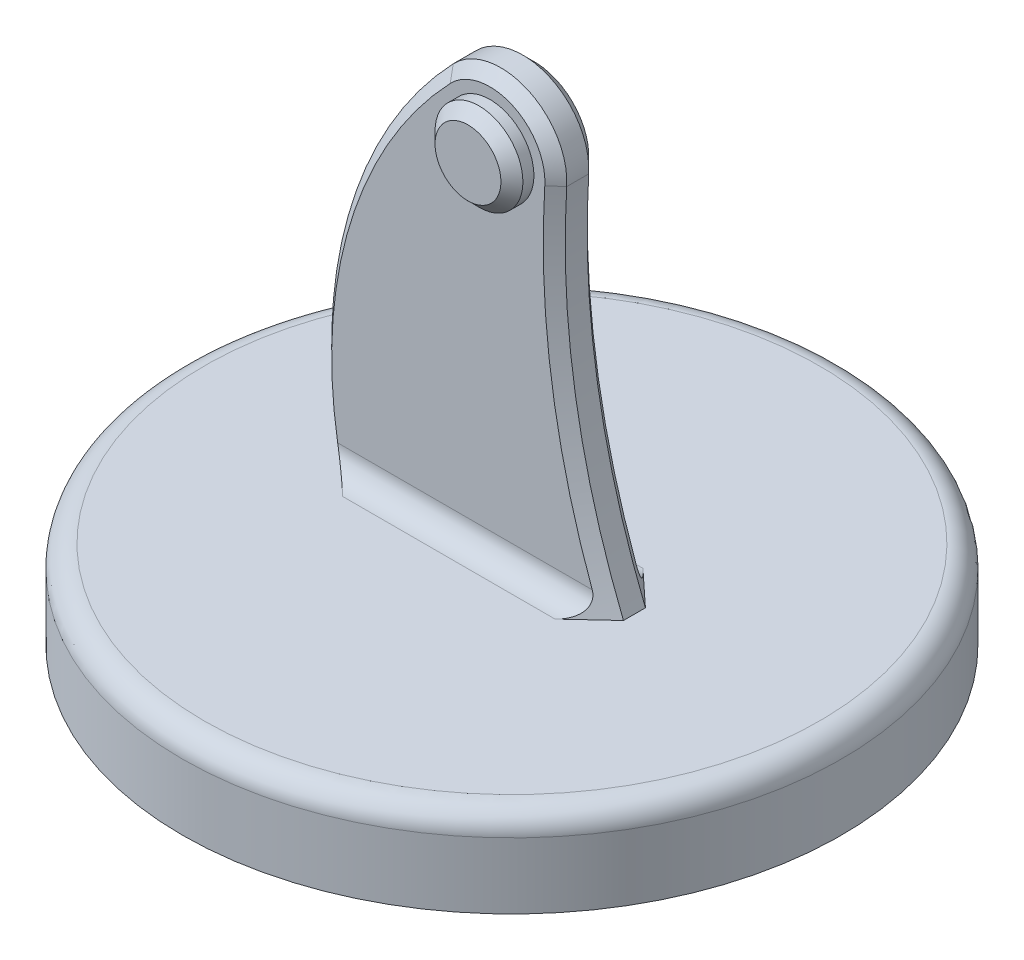
ISO-10303-21;
HEADER;
FILE_DESCRIPTION(('STEP AP214'),'2;1');
FILE_NAME('part.step','',(''),(''),'','','');
FILE_SCHEMA(('AUTOMOTIVE_DESIGN { 1 0 10303 214 1 1 1 1 }'));
ENDSEC;
DATA;
#1=APPLICATION_CONTEXT('core data for automotive mechanical design processes');
#2=APPLICATION_PROTOCOL_DEFINITION('international standard','automotive_design',2000,#1);
#3=PRODUCT_CONTEXT('',#1,'mechanical');
#4=PRODUCT('Part','Part','',(#3));
#5=PRODUCT_RELATED_PRODUCT_CATEGORY('part','',(#4));
#6=PRODUCT_DEFINITION_FORMATION('','',#4);
#7=PRODUCT_DEFINITION_CONTEXT('part definition',#1,'design');
#8=PRODUCT_DEFINITION('design','',#6,#7);
#9=PRODUCT_DEFINITION_SHAPE('','',#8);
#10=(LENGTH_UNIT() NAMED_UNIT(*) SI_UNIT(.MILLI.,.METRE.));
#11=(NAMED_UNIT(*) PLANE_ANGLE_UNIT() SI_UNIT($,.RADIAN.));
#12=(NAMED_UNIT(*) SI_UNIT($,.STERADIAN.) SOLID_ANGLE_UNIT());
#13=UNCERTAINTY_MEASURE_WITH_UNIT(LENGTH_MEASURE(1.E-05),#10,'distance_accuracy_value','');
#14=(GEOMETRIC_REPRESENTATION_CONTEXT(3) GLOBAL_UNCERTAINTY_ASSIGNED_CONTEXT((#13)) GLOBAL_UNIT_ASSIGNED_CONTEXT((#10,
#11,#12)) REPRESENTATION_CONTEXT('',''));
#15=CARTESIAN_POINT('',(0.,0.,0.));
#16=DIRECTION('',(0.,0.,1.));
#17=DIRECTION('',(1.,0.,0.));
#18=AXIS2_PLACEMENT_3D('',#15,#16,#17);
#19=CARTESIAN_POINT('',(0.,20.,0.));
#20=DIRECTION('',(0.,1.,0.));
#21=DIRECTION('',(0.,0.,1.));
#22=AXIS2_PLACEMENT_3D('',#19,#20,#21);
#23=PLANE('',#22);
#24=CARTESIAN_POINT('',(0.,20.,0.));
#25=DIRECTION('',(0.,1.,0.));
#26=DIRECTION('',(0.,0.,1.));
#27=AXIS2_PLACEMENT_3D('',#24,#25,#26);
#28=CIRCLE('',#27,70.);
#29=CARTESIAN_POINT('',(0.,20.,70.));
#30=VERTEX_POINT('',#29);
#31=EDGE_CURVE('E340',#30,#30,#28,.T.);
#32=ORIENTED_EDGE('',*,*,#31,.T.);
#33=EDGE_LOOP('',(#32));
#34=FACE_BOUND('',#33,.T.);
#35=DIRECTION('',(-1.,0.,0.));
#36=VECTOR('',#35,1.);
#37=CARTESIAN_POINT('',(0.,20.,10.));
#38=LINE('',#37,#36);
#39=CARTESIAN_POINT('',(19.8084097202196,20.,10.));
#40=VERTEX_POINT('',#39);
#41=CARTESIAN_POINT('',(-28.5347400447898,20.,10.));
#42=VERTEX_POINT('',#41);
#43=EDGE_CURVE('E123',#40,#42,#38,.T.);
#44=ORIENTED_EDGE('',*,*,#43,.T.);
#45=CARTESIAN_POINT('',(-28.5347400447898,20.,10.));
#46=CARTESIAN_POINT('',(-29.390461949538,20.,9.16727790608721));
#47=CARTESIAN_POINT('',(-30.2458713230868,20.,8.33423473892487));
#48=CARTESIAN_POINT('',(-31.9561089872227,20.,6.66755268695151));
#49=CARTESIAN_POINT('',(-32.8109372780004,20.,5.83391380233608));
#50=CARTESIAN_POINT('',(-34.5191891841925,20.,4.16693335697093));
#51=CARTESIAN_POINT('',(-35.372613344394,20.,3.33359235450626));
#52=CARTESIAN_POINT('',(-36.2257918410724,20.,2.50000000000007));
#53=B_SPLINE_CURVE_WITH_KNOTS('',3,(#45,#46,#47,#48,#49,#50,#51,#52),.UNSPECIFIED.,.F.,.F.,(4,2,
2,4),(0.,3.58206271115795,7.16412424671798,10.7425468249186),.UNSPECIFIED.);
#54=CARTESIAN_POINT('',(-36.2257918410724,20.,2.50000000000007));
#55=VERTEX_POINT('',#54);
#56=EDGE_CURVE('E119',#42,#55,#53,.T.);
#57=ORIENTED_EDGE('',*,*,#56,.T.);
#58=DIRECTION('',(0.,0.,-1.));
#59=VECTOR('',#58,1.);
#60=CARTESIAN_POINT('',(-36.2257918410724,20.,5.));
#61=LINE('',#60,#59);
#62=CARTESIAN_POINT('',(-36.2257918410724,20.,-2.50000000000005));
#63=VERTEX_POINT('',#62);
#64=EDGE_CURVE('E121',#55,#63,#61,.T.);
#65=ORIENTED_EDGE('',*,*,#64,.T.);
#66=CARTESIAN_POINT('',(-36.2257918410724,20.,-2.50000000000005));
#67=CARTESIAN_POINT('',(-35.372613344394,20.,-3.33359235450624));
#68=CARTESIAN_POINT('',(-34.5191891841924,20.,-4.16693335697092));
#69=CARTESIAN_POINT('',(-32.810937278002,20.,-5.83391380233447));
#70=CARTESIAN_POINT('',(-31.9561089872259,20.,-6.66755268694829));
#71=CARTESIAN_POINT('',(-30.2458713230932,20.,-8.33423473891845));
#72=CARTESIAN_POINT('',(-29.390461949546,20.,-9.16727790607919));
#73=CARTESIAN_POINT('',(-28.5347400447995,20.,-9.99999999999037));
#74=B_SPLINE_CURVE_WITH_KNOTS('',3,(#66,#67,#68,#69,#70,#71,#72,#73),.UNSPECIFIED.,.F.,.F.,(4,2,
2,4),(0.,3.57842257820066,7.16048411375385,10.7425468249049),.UNSPECIFIED.);
#75=CARTESIAN_POINT('',(-28.5347400447995,20.,-10.));
#76=VERTEX_POINT('',#75);
#77=EDGE_CURVE('E171',#63,#76,#74,.T.);
#78=ORIENTED_EDGE('',*,*,#77,.T.);
#79=DIRECTION('',(-1.,0.,0.));
#80=VECTOR('',#79,1.);
#81=CARTESIAN_POINT('',(25.1824752050036,20.,-10.));
#82=LINE('',#81,#80);
#83=CARTESIAN_POINT('',(19.8084097202194,20.,-10.));
#84=VERTEX_POINT('',#83);
#85=EDGE_CURVE('E127',#76,#84,#82,.F.);
#86=ORIENTED_EDGE('',*,*,#85,.T.);
#87=CARTESIAN_POINT('',(19.8084097202194,20.,-9.99999999999998));
#88=CARTESIAN_POINT('',(20.7032286114693,20.,-9.16574365323035));
#89=CARTESIAN_POINT('',(21.5984643871196,20.,-8.33193432974238));
#90=CARTESIAN_POINT('',(23.3898068938444,20.,-6.6652533617684));
#91=CARTESIAN_POINT('',(24.2859136241593,20.,-5.83238171646611));
#92=CARTESIAN_POINT('',(26.0805990637617,20.,-4.16616784041951));
#93=CARTESIAN_POINT('',(26.979179359604,20.,-3.33282731858598));
#94=CARTESIAN_POINT('',(27.8782351753599,20.,-2.50000000000006));
#95=B_SPLINE_CURVE_WITH_KNOTS('',3,(#87,#88,#89,#90,#91,#92,#93,#94),.UNSPECIFIED.,.F.,.F.,(4,2,
2,4),(0.,3.6701717097467,7.34034022201687,11.0169040821688),.UNSPECIFIED.);
#96=CARTESIAN_POINT('',(27.8782351753599,20.,-2.50000000000005));
#97=VERTEX_POINT('',#96);
#98=EDGE_CURVE('E179',#84,#97,#95,.T.);
#99=ORIENTED_EDGE('',*,*,#98,.T.);
#100=DIRECTION('',(0.,0.,-1.));
#101=VECTOR('',#100,1.);
#102=CARTESIAN_POINT('',(27.8782351753599,20.,5.));
#103=LINE('',#102,#101);
#104=CARTESIAN_POINT('',(27.8782351753599,20.,2.50000000000007));
#105=VERTEX_POINT('',#104);
#106=EDGE_CURVE('E138',#97,#105,#103,.F.);
#107=ORIENTED_EDGE('',*,*,#106,.T.);
#108=CARTESIAN_POINT('',(27.8782351753599,20.,2.50000000000007));
#109=CARTESIAN_POINT('',(26.979179359604,20.,3.33282731858598));
#110=CARTESIAN_POINT('',(26.0805990637617,20.,4.16616784041951));
#111=CARTESIAN_POINT('',(24.2859136241594,20.,5.83238171646609));
#112=CARTESIAN_POINT('',(23.3898068938444,20.,6.66525336176839));
#113=CARTESIAN_POINT('',(21.5984643871198,20.,8.33193432974238));
#114=CARTESIAN_POINT('',(20.7032286114695,20.,9.16574365323036));
#115=CARTESIAN_POINT('',(19.8084097202196,20.,10.));
#116=B_SPLINE_CURVE_WITH_KNOTS('',3,(#108,#109,#110,#111,#112,#113,#114,#115),.UNSPECIFIED.,.F.,
.F.,(4,2,2,4),(0.,3.67656386015191,7.34673237242206,11.0169040821687),.UNSPECIFIED.);
#117=EDGE_CURVE('E128',#105,#40,#116,.T.);
#118=ORIENTED_EDGE('',*,*,#117,.T.);
#119=EDGE_LOOP('',(#44,#57,#65,#78,#86,#99,#107,#118));
#120=FACE_BOUND('',#119,.T.);
#121=ADVANCED_FACE('F38',(#34,#120),#23,.T.);
#122=CARTESIAN_POINT('',(0.,20.,0.));
#123=DIRECTION('',(0.,-1.,0.));
#124=DIRECTION('',(0.,0.,-1.));
#125=AXIS2_PLACEMENT_3D('',#122,#123,#124);
#126=CYLINDRICAL_SURFACE('',#125,75.);
#127=CARTESIAN_POINT('',(0.,15.,0.));
#128=DIRECTION('',(0.,1.,0.));
#129=DIRECTION('',(0.,0.,1.));
#130=AXIS2_PLACEMENT_3D('',#127,#128,#129);
#131=CIRCLE('',#130,75.);
#132=CARTESIAN_POINT('',(0.,15.,75.));
#133=VERTEX_POINT('',#132);
#134=EDGE_CURVE('E347',#133,#133,#131,.F.);
#135=ORIENTED_EDGE('',*,*,#134,.T.);
#136=EDGE_LOOP('',(#135));
#137=FACE_BOUND('',#136,.T.);
#138=CARTESIAN_POINT('',(0.,0.,0.));
#139=DIRECTION('',(0.,1.,0.));
#140=DIRECTION('',(0.,0.,1.));
#141=AXIS2_PLACEMENT_3D('',#138,#139,#140);
#142=CIRCLE('',#141,75.);
#143=CARTESIAN_POINT('',(0.,0.,75.));
#144=VERTEX_POINT('',#143);
#145=EDGE_CURVE('E337',#144,#144,#142,.T.);
#146=ORIENTED_EDGE('',*,*,#145,.T.);
#147=EDGE_LOOP('',(#146));
#148=FACE_BOUND('',#147,.T.);
#149=ADVANCED_FACE('F195',(#137,#148),#126,.T.);
#150=CARTESIAN_POINT('',(0.,0.,0.));
#151=DIRECTION('',(0.,1.,0.));
#152=DIRECTION('',(0.,0.,1.));
#153=AXIS2_PLACEMENT_3D('',#150,#151,#152);
#154=PLANE('',#153);
#155=ORIENTED_EDGE('',*,*,#145,.F.);
#156=EDGE_LOOP('',(#155));
#157=FACE_BOUND('',#156,.T.);
#158=ADVANCED_FACE('F198',(#157),#154,.F.);
#159=CARTESIAN_POINT('',(0.,15.,0.));
#160=DIRECTION('',(0.,1.,0.));
#161=DIRECTION('',(0.,0.,1.));
#162=AXIS2_PLACEMENT_3D('',#159,#160,#161);
#163=TOROIDAL_SURFACE('',#162,70.,5.);
#164=ORIENTED_EDGE('',*,*,#134,.F.);
#165=EDGE_LOOP('',(#164));
#166=FACE_BOUND('',#165,.T.);
#167=ORIENTED_EDGE('',*,*,#31,.F.);
#168=EDGE_LOOP('',(#167));
#169=FACE_BOUND('',#168,.T.);
#170=ADVANCED_FACE('F390',(#166,#169),#163,.T.);
#171=CARTESIAN_POINT('',(61.4788080980091,41.3028437243492,5.));
#172=DIRECTION('',(0.,0.,-1.));
#173=DIRECTION('',(-1.,0.,0.));
#174=AXIS2_PLACEMENT_3D('',#171,#172,#173);
#175=CYLINDRICAL_SURFACE('',#174,100.);
#176=DIRECTION('',(0.,0.,-1.));
#177=VECTOR('',#176,1.);
#178=CARTESIAN_POINT('',(-10.8492014290605,110.358321695703,5.));
#179=LINE('',#178,#177);
#180=CARTESIAN_POINT('',(-10.8492014290605,110.358321695703,2.50000000000007));
#181=VERTEX_POINT('',#180);
#182=CARTESIAN_POINT('',(-10.8492014290605,110.358321695703,-2.50000000000005));
#183=VERTEX_POINT('',#182);
#184=EDGE_CURVE('E316',#181,#183,#179,.T.);
#185=ORIENTED_EDGE('',*,*,#184,.T.);
#186=CARTESIAN_POINT('',(61.4788080980091,41.3028437243492,-2.50000000000005));
#187=DIRECTION('',(0.,0.,-1.));
#188=DIRECTION('',(-1.,0.,0.));
#189=AXIS2_PLACEMENT_3D('',#186,#187,#188);
#190=CIRCLE('',#189,100.);
#191=EDGE_CURVE('E137',#183,#63,#190,.F.);
#192=ORIENTED_EDGE('',*,*,#191,.T.);
#193=ORIENTED_EDGE('',*,*,#64,.F.);
#194=CARTESIAN_POINT('',(61.4788080980091,41.3028437243492,2.50000000000007));
#195=DIRECTION('',(0.,0.,-1.));
#196=DIRECTION('',(-1.,0.,0.));
#197=AXIS2_PLACEMENT_3D('',#194,#195,#196);
#198=CIRCLE('',#197,100.);
#199=EDGE_CURVE('E134',#55,#181,#198,.T.);
#200=ORIENTED_EDGE('',*,*,#199,.T.);
#201=EDGE_LOOP('',(#185,#192,#193,#200));
#202=FACE_BOUND('',#201,.T.);
#203=ADVANCED_FACE('F133',(#202),#175,.T.);
#204=CARTESIAN_POINT('',(194.618391581677,87.8064911464742,5.));
#205=DIRECTION('',(0.,0.,-1.));
#206=DIRECTION('',(-1.,0.,0.));
#207=AXIS2_PLACEMENT_3D('',#204,#205,#206);
#208=CYLINDRICAL_SURFACE('',#207,180.);
#209=ORIENTED_EDGE('',*,*,#106,.F.);
#210=CARTESIAN_POINT('',(194.618391581677,87.8064911464742,-2.50000000000005));
#211=DIRECTION('',(0.,0.,-1.));
#212=DIRECTION('',(-1.,0.,0.));
#213=AXIS2_PLACEMENT_3D('',#210,#211,#212);
#214=CIRCLE('',#213,180.);
#215=CARTESIAN_POINT('',(14.9706455062829,99.0620377804981,-2.50000000000005));
#216=VERTEX_POINT('',#215);
#217=EDGE_CURVE('E162',#97,#216,#214,.T.);
#218=ORIENTED_EDGE('',*,*,#217,.T.);
#219=DIRECTION('',(0.,0.,-1.));
#220=VECTOR('',#219,1.);
#221=CARTESIAN_POINT('',(14.9706455062829,99.0620377804981,5.));
#222=LINE('',#221,#220);
#223=CARTESIAN_POINT('',(14.9706455062829,99.0620377804981,2.50000000000007));
#224=VERTEX_POINT('',#223);
#225=EDGE_CURVE('E333',#224,#216,#222,.T.);
#226=ORIENTED_EDGE('',*,*,#225,.F.);
#227=CARTESIAN_POINT('',(194.618391581677,87.8064911464742,2.50000000000007));
#228=DIRECTION('',(0.,0.,-1.));
#229=DIRECTION('',(-1.,0.,0.));
#230=AXIS2_PLACEMENT_3D('',#227,#228,#229);
#231=CIRCLE('',#230,180.);
#232=EDGE_CURVE('E160',#224,#105,#231,.F.);
#233=ORIENTED_EDGE('',*,*,#232,.T.);
#234=EDGE_LOOP('',(#209,#218,#226,#233));
#235=FACE_BOUND('',#234,.T.);
#236=ADVANCED_FACE('F332',(#235),#208,.F.);
#237=CARTESIAN_POINT('',(0.,100.,5.));
#238=DIRECTION('',(0.,0.,-1.));
#239=DIRECTION('',(-1.,0.,0.));
#240=AXIS2_PLACEMENT_3D('',#237,#238,#239);
#241=CYLINDRICAL_SURFACE('',#240,15.);
#242=ORIENTED_EDGE('',*,*,#225,.T.);
#243=CARTESIAN_POINT('',(0.,100.,-2.50000000000005));
#244=DIRECTION('',(0.,0.,-1.));
#245=DIRECTION('',(-1.,0.,0.));
#246=AXIS2_PLACEMENT_3D('',#243,#244,#245);
#247=CIRCLE('',#246,15.);
#248=EDGE_CURVE('E158',#216,#183,#247,.F.);
#249=ORIENTED_EDGE('',*,*,#248,.T.);
#250=ORIENTED_EDGE('',*,*,#184,.F.);
#251=CARTESIAN_POINT('',(0.,100.,2.50000000000007));
#252=DIRECTION('',(0.,0.,-1.));
#253=DIRECTION('',(-1.,0.,0.));
#254=AXIS2_PLACEMENT_3D('',#251,#252,#253);
#255=CIRCLE('',#254,15.);
#256=EDGE_CURVE('E156',#181,#224,#255,.T.);
#257=ORIENTED_EDGE('',*,*,#256,.T.);
#258=EDGE_LOOP('',(#242,#249,#250,#257));
#259=FACE_BOUND('',#258,.T.);
#260=ADVANCED_FACE('F295',(#259),#241,.T.);
#261=CARTESIAN_POINT('',(61.4788080980091,41.3028437243492,5.));
#262=DIRECTION('',(0.,0.,-1.));
#263=DIRECTION('',(-1.,0.,0.));
#264=AXIS2_PLACEMENT_3D('',#261,#262,#263);
#265=PLANE('',#264);
#266=CARTESIAN_POINT('',(0.,100.,5.));
#267=DIRECTION('',(0.,0.,-1.));
#268=DIRECTION('',(-1.,0.,0.));
#269=AXIS2_PLACEMENT_3D('',#266,#267,#268);
#270=CIRCLE('',#269,10.);
#271=CARTESIAN_POINT('',(-10.,100.,5.));
#272=VERTEX_POINT('',#271);
#273=EDGE_CURVE('E266',#272,#272,#270,.F.);
#274=ORIENTED_EDGE('',*,*,#273,.F.);
#275=EDGE_LOOP('',(#274));
#276=FACE_BOUND('',#275,.T.);
#277=CARTESIAN_POINT('',(61.4788080980091,41.3028437243492,5.));
#278=DIRECTION('',(0.,0.,-1.));
#279=DIRECTION('',(-1.,0.,0.));
#280=AXIS2_PLACEMENT_3D('',#277,#278,#279);
#281=CIRCLE('',#280,97.5000000000001);
#282=CARTESIAN_POINT('',(-9.04100119088378,108.631934746419,5.));
#283=VERTEX_POINT('',#282);
#284=CARTESIAN_POINT('',(-34.6485412178826,25.,5.));
#285=VERTEX_POINT('',#284);
#286=EDGE_CURVE('E166',#283,#285,#281,.F.);
#287=ORIENTED_EDGE('',*,*,#286,.T.);
#288=DIRECTION('',(-1.,0.,0.));
#289=VECTOR('',#288,1.);
#290=CARTESIAN_POINT('',(61.4788080980091,25.,5.));
#291=LINE('',#290,#289);
#292=CARTESIAN_POINT('',(23.2661384016625,25.,5.));
#293=VERTEX_POINT('',#292);
#294=EDGE_CURVE('E298',#285,#293,#291,.F.);
#295=ORIENTED_EDGE('',*,*,#294,.T.);
#296=CARTESIAN_POINT('',(194.618391581677,87.8064911464742,5.));
#297=DIRECTION('',(0.,0.,-1.));
#298=DIRECTION('',(-1.,0.,0.));
#299=AXIS2_PLACEMENT_3D('',#296,#297,#298);
#300=CIRCLE('',#299,182.5);
#301=CARTESIAN_POINT('',(12.4755379219025,99.2183648170817,5.));
#302=VERTEX_POINT('',#301);
#303=EDGE_CURVE('E169',#293,#302,#300,.T.);
#304=ORIENTED_EDGE('',*,*,#303,.T.);
#305=CARTESIAN_POINT('',(0.,100.,5.));
#306=DIRECTION('',(0.,0.,-1.));
#307=DIRECTION('',(-1.,0.,0.));
#308=AXIS2_PLACEMENT_3D('',#305,#306,#307);
#309=CIRCLE('',#308,12.5000000000001);
#310=EDGE_CURVE('E164',#302,#283,#309,.F.);
#311=ORIENTED_EDGE('',*,*,#310,.T.);
#312=EDGE_LOOP('',(#287,#295,#304,#311));
#313=FACE_BOUND('',#312,.T.);
#314=ADVANCED_FACE('F291',(#276,#313),#265,.F.);
#315=CARTESIAN_POINT('',(61.4788080980091,41.3028437243492,-5.));
#316=DIRECTION('',(0.,0.,-1.));
#317=DIRECTION('',(-1.,0.,0.));
#318=AXIS2_PLACEMENT_3D('',#315,#316,#317);
#319=PLANE('',#318);
#320=CARTESIAN_POINT('',(0.,100.,-5.));
#321=DIRECTION('',(0.,0.,-1.));
#322=DIRECTION('',(-1.,0.,0.));
#323=AXIS2_PLACEMENT_3D('',#320,#321,#322);
#324=CIRCLE('',#323,5.);
#325=CARTESIAN_POINT('',(-5.,100.,-5.));
#326=VERTEX_POINT('',#325);
#327=EDGE_CURVE('E515',#326,#326,#324,.T.);
#328=ORIENTED_EDGE('',*,*,#327,.F.);
#329=EDGE_LOOP('',(#328));
#330=FACE_BOUND('',#329,.T.);
#331=CARTESIAN_POINT('',(194.618391581677,87.8064911464742,-5.));
#332=DIRECTION('',(0.,0.,-1.));
#333=DIRECTION('',(-1.,0.,0.));
#334=AXIS2_PLACEMENT_3D('',#331,#332,#333);
#335=CIRCLE('',#334,182.5);
#336=CARTESIAN_POINT('',(12.4755379219024,99.2183648170817,-5.));
#337=VERTEX_POINT('',#336);
#338=CARTESIAN_POINT('',(23.2661384016624,25.,-5.));
#339=VERTEX_POINT('',#338);
#340=EDGE_CURVE('E147',#337,#339,#335,.F.);
#341=ORIENTED_EDGE('',*,*,#340,.T.);
#342=DIRECTION('',(-1.,0.,0.));
#343=VECTOR('',#342,1.);
#344=CARTESIAN_POINT('',(-33.6654972978261,25.,-5.));
#345=LINE('',#344,#343);
#346=CARTESIAN_POINT('',(-34.6485412178826,25.,-5.));
#347=VERTEX_POINT('',#346);
#348=EDGE_CURVE('E302',#339,#347,#345,.T.);
#349=ORIENTED_EDGE('',*,*,#348,.T.);
#350=CARTESIAN_POINT('',(61.4788080980091,41.3028437243492,-5.));
#351=DIRECTION('',(0.,0.,-1.));
#352=DIRECTION('',(-1.,0.,0.));
#353=AXIS2_PLACEMENT_3D('',#350,#351,#352);
#354=CIRCLE('',#353,97.5);
#355=CARTESIAN_POINT('',(-9.04100119088373,108.631934746419,-5.));
#356=VERTEX_POINT('',#355);
#357=EDGE_CURVE('E154',#347,#356,#354,.T.);
#358=ORIENTED_EDGE('',*,*,#357,.T.);
#359=CARTESIAN_POINT('',(0.,100.,-5.));
#360=DIRECTION('',(0.,0.,-1.));
#361=DIRECTION('',(-1.,0.,0.));
#362=AXIS2_PLACEMENT_3D('',#359,#360,#361);
#363=CIRCLE('',#362,12.5000000000001);
#364=EDGE_CURVE('E152',#356,#337,#363,.T.);
#365=ORIENTED_EDGE('',*,*,#364,.T.);
#366=EDGE_LOOP('',(#341,#349,#358,#365));
#367=FACE_BOUND('',#366,.T.);
#368=ADVANCED_FACE('F294',(#330,#367),#319,.T.);
#369=CARTESIAN_POINT('',(194.618391581677,87.8064911464742,-2.50000000000005));
#370=DIRECTION('',(0.,0.,-1.));
#371=DIRECTION('',(-1.,0.,0.));
#372=AXIS2_PLACEMENT_3D('',#369,#370,#371);
#373=CONICAL_SURFACE('',#372,180.,0.785398163397459);
#374=ORIENTED_EDGE('',*,*,#98,.F.);
#375=CARTESIAN_POINT('',(19.8084097202194,20.,-10.));
#376=CARTESIAN_POINT('',(19.9616222001359,20.0000298804788,-9.85714704113472));
#377=CARTESIAN_POINT('',(20.113792401427,20.0061250464787,-9.71309524720427));
#378=CARTESIAN_POINT('',(20.4154099258561,20.0312732005136,-9.42286389259004));
#379=CARTESIAN_POINT('',(20.5648530266056,20.0503447774578,-9.27668157427059));
#380=CARTESIAN_POINT('',(20.8615528966933,20.102562652016,-8.98125926298964));
#381=CARTESIAN_POINT('',(21.0087676549954,20.1358611613083,-8.83200332023087));
#382=CARTESIAN_POINT('',(21.2980316141233,20.2175964036353,-8.5328080602607));
#383=CARTESIAN_POINT('',(21.4400838108924,20.2660241950172,-8.38286919811184));
#384=CARTESIAN_POINT('',(21.7828151280984,20.4058352198909,-8.01276165533597));
#385=CARTESIAN_POINT('',(21.9797828513875,20.5067135935973,-7.79259954802386));
#386=CARTESIAN_POINT('',(22.3528762269486,20.7482032050806,-7.3572951911231));
#387=CARTESIAN_POINT('',(22.5290705137557,20.8886780845711,-7.14213841034354));
#388=CARTESIAN_POINT('',(22.8168193138976,21.1785477540737,-6.7689824570868));
#389=CARTESIAN_POINT('',(22.9340909878662,21.319317167827,-6.60875060095629));
#390=CARTESIAN_POINT('',(23.1447782575429,21.6294430522973,-6.30040897895644));
#391=CARTESIAN_POINT('',(23.2382153446302,21.7987735392681,-6.15228837499196));
#392=CARTESIAN_POINT('',(23.3804737185194,22.1320581970212,-5.89995104941321));
#393=CARTESIAN_POINT('',(23.434296278932,22.2915049540279,-5.79262885058205));
#394=CARTESIAN_POINT('',(23.5179262343763,22.6263855761311,-5.5950448914265));
#395=CARTESIAN_POINT('',(23.5477623016994,22.8018000739712,-5.50476286123899));
#396=CARTESIAN_POINT('',(23.5813327898913,23.1648092903734,-5.34473112728067));
#397=CARTESIAN_POINT('',(23.5849884501376,23.3524390501042,-5.27504398310998));
#398=CARTESIAN_POINT('',(23.5658130806125,23.733709875505,-5.15889768650513));
#399=CARTESIAN_POINT('',(23.5429456120538,23.9273588546122,-5.11247061551667));
#400=CARTESIAN_POINT('',(23.4808763212381,24.2692712797722,-5.05137708232073));
#401=CARTESIAN_POINT('',(23.446701744559,24.4176298806951,-5.03183845273443));
#402=CARTESIAN_POINT('',(23.3858266399032,24.63802725972,-5.01257591131647));
#403=CARTESIAN_POINT('',(23.3639728403138,24.7110279587234,-5.00782892798884));
#404=CARTESIAN_POINT('',(23.3172604092299,24.8561887780631,-5.00154052901006));
#405=CARTESIAN_POINT('',(23.2924023157314,24.92834904637,-4.99999854031963));
#406=CARTESIAN_POINT('',(23.2661384016624,25.,-4.99999999999999));
#407=B_SPLINE_CURVE_WITH_KNOTS('',3,(#375,#376,#377,#378,#379,#380,#381,#382,#383,#384,#385,
#386,#387,#388,#389,#390,#391,#392,#393,#394,#395,#396,#397,#398,#399,#400,#401,#402,#403,#404,
#405,#406),.UNSPECIFIED.,.F.,.F.,(4,2,2,2,2,2,2,2,2,2,2,2,2,2,2,4),(0.,0.628421039599246,
1.25774420264553,1.89397597557041,2.52983243422467,3.46357701051969,4.39414453597987,
5.12178326458138,5.84876355163271,6.44503340286868,7.04058943781575,7.63793638210259,
8.23610496423002,8.69534624701097,8.92427835401009,9.15316952540918),.UNSPECIFIED.);
#408=EDGE_CURVE('E54',#84,#339,#407,.T.);
#409=ORIENTED_EDGE('',*,*,#408,.T.);
#410=ORIENTED_EDGE('',*,*,#340,.F.);
#411=DIRECTION('',(-0.70572299708217,0.0442159630604395,-0.707106781186546));
#412=VECTOR('',#411,1.);
#413=CARTESIAN_POINT('',(14.9706455062829,99.0620377804981,-2.50000000000005));
#414=LINE('',#413,#412);
#415=EDGE_CURVE('E314',#216,#337,#414,.T.);
#416=ORIENTED_EDGE('',*,*,#415,.F.);
#417=ORIENTED_EDGE('',*,*,#217,.F.);
#418=EDGE_LOOP('',(#374,#409,#410,#416,#417));
#419=FACE_BOUND('',#418,.T.);
#420=ADVANCED_FACE('F226',(#419),#373,.F.);
#421=CARTESIAN_POINT('',(0.,100.,-2.50000000000005));
#422=DIRECTION('',(0.,0.,1.));
#423=DIRECTION('',(1.,0.,0.));
#424=AXIS2_PLACEMENT_3D('',#421,#422,#423);
#425=CONICAL_SURFACE('',#424,15.,0.785398163397456);
#426=ORIENTED_EDGE('',*,*,#415,.T.);
#427=ORIENTED_EDGE('',*,*,#364,.F.);
#428=DIRECTION('',(0.511436260063164,-0.488295967516231,-0.707106781186541));
#429=VECTOR('',#428,1.);
#430=CARTESIAN_POINT('',(-10.8492014290605,110.358321695703,-2.50000000000005));
#431=LINE('',#430,#429);
#432=EDGE_CURVE('E309',#183,#356,#431,.T.);
#433=ORIENTED_EDGE('',*,*,#432,.F.);
#434=ORIENTED_EDGE('',*,*,#248,.F.);
#435=EDGE_LOOP('',(#426,#427,#433,#434));
#436=FACE_BOUND('',#435,.T.);
#437=ADVANCED_FACE('F324',(#436),#425,.T.);
#438=CARTESIAN_POINT('',(61.4788080980091,41.3028437243492,-2.50000000000005));
#439=DIRECTION('',(0.,0.,1.));
#440=DIRECTION('',(1.,0.,0.));
#441=AXIS2_PLACEMENT_3D('',#438,#439,#440);
#442=CONICAL_SURFACE('',#441,100.,0.785398163397459);
#443=ORIENTED_EDGE('',*,*,#432,.T.);
#444=ORIENTED_EDGE('',*,*,#357,.F.);
#445=CARTESIAN_POINT('',(-34.6485412178826,25.,-5.));
#446=CARTESIAN_POINT('',(-34.6278263931646,24.8776737195309,-4.99997205696549));
#447=CARTESIAN_POINT('',(-34.6024065399033,24.7562262915276,-5.00448739117207));
#448=CARTESIAN_POINT('',(-34.5429849208855,24.5162780856462,-5.02201019394859));
#449=CARTESIAN_POINT('',(-34.508997529844,24.3977727337697,-5.03500349551893));
#450=CARTESIAN_POINT('',(-34.4336064530607,24.1657504184647,-5.06870753536354));
#451=CARTESIAN_POINT('',(-34.3922873438699,24.0521932495797,-5.08933290323475));
#452=CARTESIAN_POINT('',(-34.3028186663442,23.8293395597508,-5.13763804893629));
#453=CARTESIAN_POINT('',(-34.2546663483714,23.7200447766429,-5.16532067014758));
#454=CARTESIAN_POINT('',(-34.1018999874642,23.4007855163625,-5.25749953763443));
#455=CARTESIAN_POINT('',(-33.9883894250089,23.1977010164338,-5.33139897333394));
#456=CARTESIAN_POINT('',(-33.743108128065,22.8114075187661,-5.4994796684437));
#457=CARTESIAN_POINT('',(-33.6112792288648,22.6282652833932,-5.59372608368113));
#458=CARTESIAN_POINT('',(-33.3597715899798,22.3143795242673,-5.77930779563056));
#459=CARTESIAN_POINT('',(-33.2423430904442,22.1802045011359,-5.86796813176536));
#460=CARTESIAN_POINT('',(-33.0003701704359,21.9250062885372,-6.05419427532));
#461=CARTESIAN_POINT('',(-32.875822262786,21.803989629899,-6.15176446112314));
#462=CARTESIAN_POINT('',(-32.620958183914,21.574515672378,-6.35451763345835));
#463=CARTESIAN_POINT('',(-32.4906317175557,21.4660821453441,-6.45971443821712));
#464=CARTESIAN_POINT('',(-32.2256565914918,21.261571364397,-6.67639624695989));
#465=CARTESIAN_POINT('',(-32.0910081512861,21.1654934842151,-6.78788093181869));
#466=CARTESIAN_POINT('',(-31.767082979519,20.9513521781691,-7.05916234626258));
#467=CARTESIAN_POINT('',(-31.5762977372455,20.8386006241572,-7.22136644551829));
#468=CARTESIAN_POINT('',(-31.19037990133,20.6347373401019,-7.55407285197026));
#469=CARTESIAN_POINT('',(-30.9952453847091,20.543635398434,-7.72457887087087));
#470=CARTESIAN_POINT('',(-30.6024455629515,20.3825905264103,-8.07225279463919));
#471=CARTESIAN_POINT('',(-30.4047817757244,20.312635473578,-8.24941681705508));
#472=CARTESIAN_POINT('',(-30.0083154260172,20.1935947017099,-8.60919264195969));
#473=CARTESIAN_POINT('',(-29.8095134145846,20.144499628215,-8.79180196315534));
#474=CARTESIAN_POINT('',(-29.4304409321058,20.0707858186542,-9.14430295407236));
#475=CARTESIAN_POINT('',(-29.2501629713123,20.0443183217429,-9.31380200505617));
#476=CARTESIAN_POINT('',(-28.8911755946429,20.0089730286601,-9.65518491269286));
#477=CARTESIAN_POINT('',(-28.7124631020954,20.0000429318062,-9.82706013433487));
#478=CARTESIAN_POINT('',(-28.5347400447948,20.,-9.99999999999494));
#479=B_SPLINE_CURVE_WITH_KNOTS('',3,(#445,#446,#447,#448,#449,#450,#451,#452,#453,#454,#455,
#456,#457,#458,#459,#460,#461,#462,#463,#464,#465,#466,#467,#468,#469,#470,#471,#472,#473,#474,
#475,#476,#477,#478),.UNSPECIFIED.,.F.,.F.,(4,2,2,2,2,2,2,2,2,2,2,2,2,2,2,2,4),(0.,
0.371910340457602,0.743200791013907,1.11045779196235,1.47786299596238,2.20715942536885,
2.93882682183085,3.53541228861897,4.13229251712416,4.73028261116157,5.3282423830098,
6.15097947183995,6.97408783764379,7.79672345698739,8.61898978287114,9.36494146338218,
10.1086651405442),.UNSPECIFIED.);
#480=EDGE_CURVE('E62',#347,#76,#479,.T.);
#481=ORIENTED_EDGE('',*,*,#480,.T.);
#482=ORIENTED_EDGE('',*,*,#77,.F.);
#483=ORIENTED_EDGE('',*,*,#191,.F.);
#484=EDGE_LOOP('',(#443,#444,#481,#482,#483));
#485=FACE_BOUND('',#484,.T.);
#486=ADVANCED_FACE('F187',(#485),#442,.T.);
#487=CARTESIAN_POINT('',(61.4788080980091,41.3028437243492,5.));
#488=DIRECTION('',(0.,0.,-1.));
#489=DIRECTION('',(-1.,0.,0.));
#490=AXIS2_PLACEMENT_3D('',#487,#488,#489);
#491=CONICAL_SURFACE('',#490,97.5000000000001,0.785398163397446);
#492=ORIENTED_EDGE('',*,*,#56,.F.);
#493=CARTESIAN_POINT('',(-28.5347400447898,20.,10.));
#494=CARTESIAN_POINT('',(-28.6394037298976,20.000005434771,9.89815059591553));
#495=CARTESIAN_POINT('',(-28.7444044701098,20.0031117141702,9.79667872726323));
#496=CARTESIAN_POINT('',(-28.9548959740976,20.015430758412,9.59462953884506));
#497=CARTESIAN_POINT('',(-29.0603867081501,20.0246431575365,9.49405216587013));
#498=CARTESIAN_POINT('',(-29.3774210581306,20.0613070700192,9.19377282554195));
#499=CARTESIAN_POINT('',(-29.5894429565537,20.0977851443199,8.99560518423251));
#500=CARTESIAN_POINT('',(-30.0149470348642,20.1948303369437,8.60300164617535));
#501=CARTESIAN_POINT('',(-30.2284255574995,20.2556075268316,8.40861421626865));
#502=CARTESIAN_POINT('',(-30.6533009098755,20.4012836398836,8.02679361368094));
#503=CARTESIAN_POINT('',(-30.864698419037,20.486174400497,7.8393581119736));
#504=CARTESIAN_POINT('',(-31.2358180513901,20.6583962515183,7.51482560986987));
#505=CARTESIAN_POINT('',(-31.3963375276234,20.7407622681903,7.37599142315452));
#506=CARTESIAN_POINT('',(-31.7140120771385,20.920552010497,7.1043781144569));
#507=CARTESIAN_POINT('',(-31.8711678474208,21.0179725815724,6.97159773148074));
#508=CARTESIAN_POINT('',(-32.1804856522052,21.2281280967814,6.71357483416337));
#509=CARTESIAN_POINT('',(-32.332660474766,21.340819251485,6.58831219251086));
#510=CARTESIAN_POINT('',(-32.6308687242773,21.5823060586907,6.3464316457991));
#511=CARTESIAN_POINT('',(-32.7769045910205,21.7110952309635,6.22981029212437));
#512=CARTESIAN_POINT('',(-33.1114401131508,22.0342782323158,5.96739519381319));
#513=CARTESIAN_POINT('',(-33.2966353855767,22.2357416578195,5.82592043060815));
#514=CARTESIAN_POINT('',(-33.6456704142066,22.6710303913349,5.5683239835165));
#515=CARTESIAN_POINT('',(-33.8095301722192,22.9048249589202,5.45217848375559));
#516=CARTESIAN_POINT('',(-34.0707148956105,23.3443131711605,5.27769119806797));
#517=CARTESIAN_POINT('',(-34.1745553911899,23.5431850809405,5.21216424392806));
#518=CARTESIAN_POINT('',(-34.312910319224,23.8535368517303,5.13204069721148));
#519=CARTESIAN_POINT('',(-34.356093990183,23.9588861391615,5.10837492195165));
#520=CARTESIAN_POINT('',(-34.4360284136757,24.1732140859586,5.06762637880012));
#521=CARTESIAN_POINT('',(-34.4727823057825,24.2821909429161,5.05054039316327));
#522=CARTESIAN_POINT('',(-34.5357563799721,24.4918108462674,5.02489103654147));
#523=CARTESIAN_POINT('',(-34.5626708259067,24.5921598661022,5.01563242611837));
#524=CARTESIAN_POINT('',(-34.610349029853,24.7948018697914,5.00317605161259));
#525=CARTESIAN_POINT('',(-34.6311052843734,24.8970970648735,4.99998565599897));
#526=CARTESIAN_POINT('',(-34.6485412178826,25.,5.));
#527=B_SPLINE_CURVE_WITH_KNOTS('',3,(#493,#494,#495,#496,#497,#498,#499,#500,#501,#502,#503,
#504,#505,#506,#507,#508,#509,#510,#511,#512,#513,#514,#515,#516,#517,#518,#519,#520,#521,#522,
#523,#524,#525,#526),.UNSPECIFIED.,.F.,.F.,(4,2,2,2,2,2,2,2,2,2,2,2,2,2,2,2,4),(0.,
0.438046358396584,0.876066482945878,1.75245654359021,2.6365929584455,3.52043044513259,
4.20284499036565,4.8851167346073,5.56547186306219,6.24555399245982,7.1667857113255,
8.08714747013588,8.78553853656555,9.13405477040999,9.48240035064393,9.79495848648629,
10.1078959115209),.UNSPECIFIED.);
#528=EDGE_CURVE('E239',#42,#285,#527,.T.);
#529=ORIENTED_EDGE('',*,*,#528,.T.);
#530=ORIENTED_EDGE('',*,*,#286,.F.);
#531=DIRECTION('',(0.51143626006316,-0.488295967516224,0.70710678118655));
#532=VECTOR('',#531,1.);
#533=CARTESIAN_POINT('',(-10.8492014290604,110.358321695703,2.50000000000007));
#534=LINE('',#533,#532);
#535=EDGE_CURVE('E144',#181,#283,#534,.T.);
#536=ORIENTED_EDGE('',*,*,#535,.F.);
#537=ORIENTED_EDGE('',*,*,#199,.F.);
#538=EDGE_LOOP('',(#492,#529,#530,#536,#537));
#539=FACE_BOUND('',#538,.T.);
#540=ADVANCED_FACE('F141',(#539),#491,.T.);
#541=CARTESIAN_POINT('',(0.,100.,5.));
#542=DIRECTION('',(0.,0.,-1.));
#543=DIRECTION('',(-1.,0.,0.));
#544=AXIS2_PLACEMENT_3D('',#541,#542,#543);
#545=CONICAL_SURFACE('',#544,12.5000000000001,0.785398163397446);
#546=ORIENTED_EDGE('',*,*,#535,.T.);
#547=ORIENTED_EDGE('',*,*,#310,.F.);
#548=DIRECTION('',(-0.705722997082166,0.044215963060444,0.707106781186549));
#549=VECTOR('',#548,1.);
#550=CARTESIAN_POINT('',(14.9706455062829,99.0620377804981,2.50000000000007));
#551=LINE('',#550,#549);
#552=EDGE_CURVE('E310',#224,#302,#551,.T.);
#553=ORIENTED_EDGE('',*,*,#552,.F.);
#554=ORIENTED_EDGE('',*,*,#256,.F.);
#555=EDGE_LOOP('',(#546,#547,#553,#554));
#556=FACE_BOUND('',#555,.T.);
#557=ADVANCED_FACE('F223',(#556),#545,.T.);
#558=CARTESIAN_POINT('',(194.618391581677,87.8064911464742,5.));
#559=DIRECTION('',(0.,0.,1.));
#560=DIRECTION('',(1.,0.,0.));
#561=AXIS2_PLACEMENT_3D('',#558,#559,#560);
#562=CONICAL_SURFACE('',#561,182.5,0.785398163397451);
#563=ORIENTED_EDGE('',*,*,#117,.F.);
#564=ORIENTED_EDGE('',*,*,#232,.F.);
#565=ORIENTED_EDGE('',*,*,#552,.T.);
#566=ORIENTED_EDGE('',*,*,#303,.F.);
#567=CARTESIAN_POINT('',(23.2661384016625,25.,5.));
#568=CARTESIAN_POINT('',(23.3002005671834,24.9070970588888,4.99998982101167));
#569=CARTESIAN_POINT('',(23.331900365859,24.8132947634358,5.00258916549921));
#570=CARTESIAN_POINT('',(23.3901604515584,24.624343126443,5.01323591479231));
#571=CARTESIAN_POINT('',(23.4167170425789,24.5291928685387,5.02128721893147));
#572=CARTESIAN_POINT('',(23.4642590261446,24.3379983044757,5.04308274610182));
#573=CARTESIAN_POINT('',(23.4852365999853,24.2419529368185,5.05683489026829));
#574=CARTESIAN_POINT('',(23.5211837982654,24.0497650147842,5.09015681555101));
#575=CARTESIAN_POINT('',(23.5361548951621,23.9536224900255,5.10972516880294));
#576=CARTESIAN_POINT('',(23.5598434730771,23.7615087850931,5.15480488443814));
#577=CARTESIAN_POINT('',(23.5685335526407,23.6655401561134,5.18034165170113));
#578=CARTESIAN_POINT('',(23.5793589711211,23.4749236099918,5.23722376580067));
#579=CARTESIAN_POINT('',(23.5814919758391,23.3802761751035,5.26857117691084));
#580=CARTESIAN_POINT('',(23.5791344482647,23.1932936963799,5.33677201100208));
#581=CARTESIAN_POINT('',(23.5746576512135,23.1009542616797,5.37361387353917));
#582=CARTESIAN_POINT('',(23.5591775223306,22.919061246429,5.45252524641229));
#583=CARTESIAN_POINT('',(23.548171730481,22.8295087293356,5.49459672245526));
#584=CARTESIAN_POINT('',(23.5205328957292,22.6581681393704,5.58133674973435));
#585=CARTESIAN_POINT('',(23.5042028834639,22.5762147571267,5.62577615786903));
#586=CARTESIAN_POINT('',(23.4660960259121,22.4158463901558,5.71855815688245));
#587=CARTESIAN_POINT('',(23.4443173998561,22.3374325721739,5.76690202034876));
#588=CARTESIAN_POINT('',(23.3712669897885,22.1079558946016,5.91717329223244));
#589=CARTESIAN_POINT('',(23.3122859316016,21.9626892734793,6.02432427062642));
#590=CARTESIAN_POINT('',(23.1519246056422,21.6389242665395,6.29030441266746));
#591=CARTESIAN_POINT('',(23.0429297160746,21.4679275550975,6.4536187634793));
#592=CARTESIAN_POINT('',(22.8002588719764,21.1580788280493,6.79181102146743));
#593=CARTESIAN_POINT('',(22.6665421365393,21.0192807927284,6.96670772427775));
#594=CARTESIAN_POINT('',(22.3197638247352,20.7186526437609,7.3988547587763));
#595=CARTESIAN_POINT('',(22.0972299147783,20.5723698914755,7.65932857124398));
#596=CARTESIAN_POINT('',(21.7458214725294,20.3928428518393,8.05194856088023));
#597=CARTESIAN_POINT('',(21.6254999159945,20.3395856596789,8.18339715955418));
#598=CARTESIAN_POINT('',(21.3800348286691,20.2454846645251,8.44627656448096));
#599=CARTESIAN_POINT('',(21.2548922835546,20.2046383390844,8.57770736891519));
#600=CARTESIAN_POINT('',(21.0216039690426,20.1402893934769,8.81843555286566));
#601=CARTESIAN_POINT('',(20.9140295433624,20.115042165326,8.92783397103434));
#602=CARTESIAN_POINT('',(20.6966536902157,20.0722321318853,9.14592246129716));
#603=CARTESIAN_POINT('',(20.5868522553935,20.0546693519809,9.25461253105013));
#604=CARTESIAN_POINT('',(20.3664141647907,20.0269838470988,9.47008454014685));
#605=CARTESIAN_POINT('',(20.2557937252114,20.0167960789621,9.57687485159776));
#606=CARTESIAN_POINT('',(20.0331107499653,20.0033093732439,9.78932326315864));
#607=CARTESIAN_POINT('',(19.9210486204086,20.0000085366556,9.89498166738483));
#608=CARTESIAN_POINT('',(19.8084097202196,20.,9.99999999999999));
#609=B_SPLINE_CURVE_WITH_KNOTS('',3,(#567,#568,#569,#570,#571,#572,#573,#574,#575,#576,#577,
#578,#579,#580,#581,#582,#583,#584,#585,#586,#587,#588,#589,#590,#591,#592,#593,#594,#595,#596,
#597,#598,#599,#600,#601,#602,#603,#604,#605,#606,#607,#608),.UNSPECIFIED.,.F.,.F.,(4,2,2,2,2,2,
2,2,2,2,2,2,2,2,2,2,2,2,2,2,4),(0.,0.29683137779651,0.593875278954078,0.891333303938968,
1.18871836397785,1.48739308625392,1.78617411897319,2.08433515458883,2.3826086037972,
2.66622794573051,2.94994010430047,3.51747042312946,4.29430082789702,5.07242430682298,
6.18341813208098,6.74108455291982,7.29863755488185,7.76491483358028,8.23119365260231,
8.69330833935969,9.15529558547916),.UNSPECIFIED.);
#610=EDGE_CURVE('E230',#293,#40,#609,.T.);
#611=ORIENTED_EDGE('',*,*,#610,.T.);
#612=EDGE_LOOP('',(#563,#564,#565,#566,#611));
#613=FACE_BOUND('',#612,.T.);
#614=ADVANCED_FACE('F215',(#613),#562,.F.);
#615=CARTESIAN_POINT('',(0.,25.,10.));
#616=DIRECTION('',(-1.,0.,0.));
#617=DIRECTION('',(0.,0.,1.));
#618=AXIS2_PLACEMENT_3D('',#615,#616,#617);
#619=CYLINDRICAL_SURFACE('',#618,5.);
#620=ORIENTED_EDGE('',*,*,#610,.F.);
#621=ORIENTED_EDGE('',*,*,#294,.F.);
#622=ORIENTED_EDGE('',*,*,#528,.F.);
#623=ORIENTED_EDGE('',*,*,#43,.F.);
#624=EDGE_LOOP('',(#620,#621,#622,#623));
#625=FACE_BOUND('',#624,.T.);
#626=ADVANCED_FACE('F222',(#625),#619,.F.);
#627=CARTESIAN_POINT('',(61.4788080980091,25.,-10.));
#628=DIRECTION('',(1.,0.,0.));
#629=DIRECTION('',(0.,0.,-1.));
#630=AXIS2_PLACEMENT_3D('',#627,#628,#629);
#631=CYLINDRICAL_SURFACE('',#630,5.);
#632=ORIENTED_EDGE('',*,*,#408,.F.);
#633=ORIENTED_EDGE('',*,*,#85,.F.);
#634=ORIENTED_EDGE('',*,*,#480,.F.);
#635=ORIENTED_EDGE('',*,*,#348,.F.);
#636=EDGE_LOOP('',(#632,#633,#634,#635));
#637=FACE_BOUND('',#636,.T.);
#638=ADVANCED_FACE('F252',(#637),#631,.F.);
#639=CARTESIAN_POINT('',(0.,100.,10.));
#640=DIRECTION('',(0.,0.,-1.));
#641=DIRECTION('',(-1.,0.,0.));
#642=AXIS2_PLACEMENT_3D('',#639,#640,#641);
#643=CYLINDRICAL_SURFACE('',#642,10.);
#644=CARTESIAN_POINT('',(0.,100.,7.49999999999994));
#645=DIRECTION('',(0.,0.,1.));
#646=DIRECTION('',(1.,0.,0.));
#647=AXIS2_PLACEMENT_3D('',#644,#645,#646);
#648=CIRCLE('',#647,10.);
#649=CARTESIAN_POINT('',(10.,100.,7.49999999999994));
#650=VERTEX_POINT('',#649);
#651=EDGE_CURVE('E11',#650,#650,#648,.F.);
#652=ORIENTED_EDGE('',*,*,#651,.T.);
#653=EDGE_LOOP('',(#652));
#654=FACE_BOUND('',#653,.T.);
#655=ORIENTED_EDGE('',*,*,#273,.T.);
#656=EDGE_LOOP('',(#655));
#657=FACE_BOUND('',#656,.T.);
#658=ADVANCED_FACE('F259',(#654,#657),#643,.T.);
#659=CARTESIAN_POINT('',(0.,100.,10.));
#660=DIRECTION('',(0.,0.,1.));
#661=DIRECTION('',(1.,0.,0.));
#662=AXIS2_PLACEMENT_3D('',#659,#660,#661);
#663=PLANE('',#662);
#664=CARTESIAN_POINT('',(0.,100.,10.));
#665=DIRECTION('',(0.,0.,1.));
#666=DIRECTION('',(1.,0.,0.));
#667=AXIS2_PLACEMENT_3D('',#664,#665,#666);
#668=CIRCLE('',#667,7.49999999999998);
#669=CARTESIAN_POINT('',(7.49999999999998,100.,10.));
#670=VERTEX_POINT('',#669);
#671=EDGE_CURVE('E47',#670,#670,#668,.T.);
#672=ORIENTED_EDGE('',*,*,#671,.T.);
#673=EDGE_LOOP('',(#672));
#674=FACE_BOUND('',#673,.T.);
#675=ADVANCED_FACE('F271',(#674),#663,.T.);
#676=CARTESIAN_POINT('',(0.,100.,10.));
#677=DIRECTION('',(0.,0.,-1.));
#678=DIRECTION('',(-1.,0.,0.));
#679=AXIS2_PLACEMENT_3D('',#676,#677,#678);
#680=CONICAL_SURFACE('',#679,7.49999999999998,0.785398163397441);
#681=ORIENTED_EDGE('',*,*,#651,.F.);
#682=EDGE_LOOP('',(#681));
#683=FACE_BOUND('',#682,.T.);
#684=ORIENTED_EDGE('',*,*,#671,.F.);
#685=EDGE_LOOP('',(#684));
#686=FACE_BOUND('',#685,.T.);
#687=ADVANCED_FACE('F41',(#683,#686),#680,.T.);
#688=CARTESIAN_POINT('',(0.,100.,5.));
#689=DIRECTION('',(0.,0.,-1.));
#690=DIRECTION('',(-1.,0.,0.));
#691=AXIS2_PLACEMENT_3D('',#688,#689,#690);
#692=CYLINDRICAL_SURFACE('',#691,5.);
#693=CARTESIAN_POINT('',(0.,100.,5.));
#694=DIRECTION('',(0.,0.,-1.));
#695=DIRECTION('',(-1.,0.,0.));
#696=AXIS2_PLACEMENT_3D('',#693,#694,#695);
#697=CIRCLE('',#696,5.);
#698=CARTESIAN_POINT('',(-5.,100.,5.));
#699=VERTEX_POINT('',#698);
#700=EDGE_CURVE('E313',#699,#699,#697,.T.);
#701=ORIENTED_EDGE('',*,*,#700,.F.);
#702=EDGE_LOOP('',(#701));
#703=FACE_BOUND('',#702,.T.);
#704=ORIENTED_EDGE('',*,*,#327,.T.);
#705=EDGE_LOOP('',(#704));
#706=FACE_BOUND('',#705,.T.);
#707=ADVANCED_FACE('F274',(#703,#706),#692,.F.);
#708=CARTESIAN_POINT('',(0.,100.,5.));
#709=DIRECTION('',(0.,0.,-1.));
#710=DIRECTION('',(-1.,0.,0.));
#711=AXIS2_PLACEMENT_3D('',#708,#709,#710);
#712=PLANE('',#711);
#713=ORIENTED_EDGE('',*,*,#700,.T.);
#714=EDGE_LOOP('',(#713));
#715=FACE_BOUND('',#714,.T.);
#716=ADVANCED_FACE('F280',(#715),#712,.T.);
#717=CLOSED_SHELL('',(#121,#149,#158,#170,#203,#236,#260,#314,#368,#420,#437,#486,#540,#557,
#614,#626,#638,#658,#675,#687,#707,#716));
#718=MANIFOLD_SOLID_BREP('B2',#717);
#719=ADVANCED_BREP_SHAPE_REPRESENTATION('',(#18,#718),#14);
#720=SHAPE_DEFINITION_REPRESENTATION(#9,#719);
ENDSEC;
END-ISO-10303-21;
